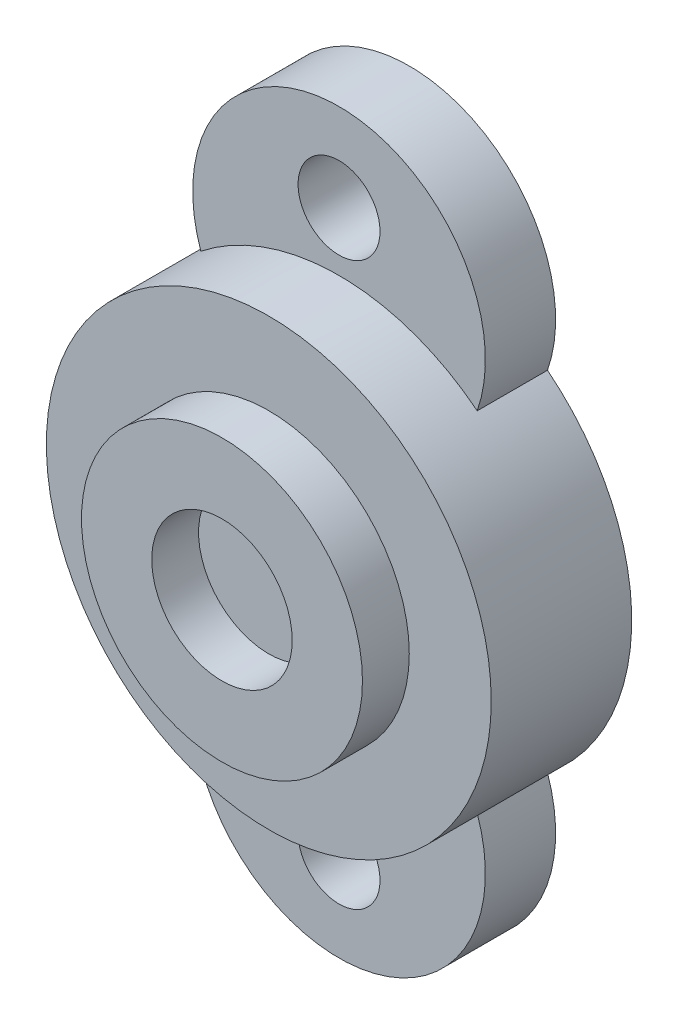
ISO-10303-21;
HEADER;
FILE_DESCRIPTION(('STEP AP214'),'2;1');
FILE_NAME('part.step','',(''),(''),'','','');
FILE_SCHEMA(('AUTOMOTIVE_DESIGN { 1 0 10303 214 1 1 1 1 }'));
ENDSEC;
DATA;
#1=APPLICATION_CONTEXT('core data for automotive mechanical design processes');
#2=APPLICATION_PROTOCOL_DEFINITION('international standard','automotive_design',2000,#1);
#3=PRODUCT_CONTEXT('',#1,'mechanical');
#4=PRODUCT('Part','Part','',(#3));
#5=PRODUCT_RELATED_PRODUCT_CATEGORY('part','',(#4));
#6=PRODUCT_DEFINITION_FORMATION('','',#4);
#7=PRODUCT_DEFINITION_CONTEXT('part definition',#1,'design');
#8=PRODUCT_DEFINITION('design','',#6,#7);
#9=PRODUCT_DEFINITION_SHAPE('','',#8);
#10=(LENGTH_UNIT() NAMED_UNIT(*) SI_UNIT(.MILLI.,.METRE.));
#11=(NAMED_UNIT(*) PLANE_ANGLE_UNIT() SI_UNIT($,.RADIAN.));
#12=(NAMED_UNIT(*) SI_UNIT($,.STERADIAN.) SOLID_ANGLE_UNIT());
#13=UNCERTAINTY_MEASURE_WITH_UNIT(LENGTH_MEASURE(1.E-05),#10,'distance_accuracy_value','');
#14=(GEOMETRIC_REPRESENTATION_CONTEXT(3) GLOBAL_UNCERTAINTY_ASSIGNED_CONTEXT((#13)) GLOBAL_UNIT_ASSIGNED_CONTEXT((#10,
#11,#12)) REPRESENTATION_CONTEXT('',''));
#15=CARTESIAN_POINT('',(0.,0.,0.));
#16=DIRECTION('',(0.,0.,1.));
#17=DIRECTION('',(1.,0.,0.));
#18=AXIS2_PLACEMENT_3D('',#15,#16,#17);
#19=CARTESIAN_POINT('',(0.,-57.3678575549034,6.));
#20=DIRECTION('',(0.,0.,1.));
#21=DIRECTION('',(1.,0.,0.));
#22=AXIS2_PLACEMENT_3D('',#19,#20,#21);
#23=PLANE('',#22);
#24=CARTESIAN_POINT('',(0.,-24.,6.));
#25=DIRECTION('',(0.,0.,1.));
#26=DIRECTION('',(1.,0.,0.));
#27=AXIS2_PLACEMENT_3D('',#24,#25,#26);
#28=CIRCLE('',#27,3.5);
#29=CARTESIAN_POINT('',(3.5,-24.,6.));
#30=VERTEX_POINT('',#29);
#31=EDGE_CURVE('E118',#30,#30,#28,.T.);
#32=ORIENTED_EDGE('',*,*,#31,.F.);
#33=EDGE_LOOP('',(#32));
#34=FACE_BOUND('',#33,.T.);
#35=CARTESIAN_POINT('',(0.,-19.,6.));
#36=DIRECTION('',(0.,0.,1.));
#37=DIRECTION('',(1.,0.,0.));
#38=AXIS2_PLACEMENT_3D('',#35,#36,#37);
#39=CIRCLE('',#38,12.5);
#40=CARTESIAN_POINT('',(-11.8043532013146,-14.8881578947368,6.));
#41=VERTEX_POINT('',#40);
#42=CARTESIAN_POINT('',(11.8043532013146,-14.8881578947368,6.));
#43=VERTEX_POINT('',#42);
#44=EDGE_CURVE('E45',#41,#43,#39,.T.);
#45=ORIENTED_EDGE('',*,*,#44,.T.);
#46=CARTESIAN_POINT('',(0.,0.,6.));
#47=DIRECTION('',(0.,0.,1.));
#48=DIRECTION('',(1.,0.,0.));
#49=AXIS2_PLACEMENT_3D('',#46,#47,#48);
#50=CIRCLE('',#49,19.);
#51=EDGE_CURVE('E49',#41,#43,#50,.T.);
#52=ORIENTED_EDGE('',*,*,#51,.F.);
#53=EDGE_LOOP('',(#45,#52));
#54=FACE_BOUND('',#53,.T.);
#55=ADVANCED_FACE('F29',(#34,#54),#23,.T.);
#56=CARTESIAN_POINT('',(0.,24.,6.));
#57=DIRECTION('',(0.,0.,1.));
#58=DIRECTION('',(1.,0.,0.));
#59=AXIS2_PLACEMENT_3D('',#56,#57,#58);
#60=CIRCLE('',#59,3.5);
#61=CARTESIAN_POINT('',(3.5,24.,6.));
#62=VERTEX_POINT('',#61);
#63=EDGE_CURVE('E121',#62,#62,#60,.T.);
#64=ORIENTED_EDGE('',*,*,#63,.F.);
#65=EDGE_LOOP('',(#64));
#66=FACE_BOUND('',#65,.T.);
#67=CARTESIAN_POINT('',(0.,19.,6.));
#68=DIRECTION('',(0.,0.,1.));
#69=DIRECTION('',(1.,0.,0.));
#70=AXIS2_PLACEMENT_3D('',#67,#68,#69);
#71=CIRCLE('',#70,12.5);
#72=CARTESIAN_POINT('',(11.8043532013146,14.8881578947368,6.));
#73=VERTEX_POINT('',#72);
#74=CARTESIAN_POINT('',(-11.8043532013146,14.8881578947368,6.));
#75=VERTEX_POINT('',#74);
#76=EDGE_CURVE('E84',#73,#75,#71,.T.);
#77=ORIENTED_EDGE('',*,*,#76,.T.);
#78=EDGE_CURVE('E77',#73,#75,#50,.T.);
#79=ORIENTED_EDGE('',*,*,#78,.F.);
#80=EDGE_LOOP('',(#77,#79));
#81=FACE_BOUND('',#80,.T.);
#82=ADVANCED_FACE('F88',(#66,#81),#23,.T.);
#83=CARTESIAN_POINT('',(0.,0.,16.));
#84=DIRECTION('',(0.,0.,-1.));
#85=DIRECTION('',(-1.,0.,0.));
#86=AXIS2_PLACEMENT_3D('',#83,#84,#85);
#87=CYLINDRICAL_SURFACE('',#86,6.);
#88=CARTESIAN_POINT('',(0.,0.,0.));
#89=DIRECTION('',(0.,0.,1.));
#90=DIRECTION('',(1.,0.,0.));
#91=AXIS2_PLACEMENT_3D('',#88,#89,#90);
#92=CIRCLE('',#91,6.);
#93=CARTESIAN_POINT('',(6.,0.,0.));
#94=VERTEX_POINT('',#93);
#95=EDGE_CURVE('E97',#94,#94,#92,.T.);
#96=ORIENTED_EDGE('',*,*,#95,.F.);
#97=EDGE_LOOP('',(#96));
#98=FACE_BOUND('',#97,.T.);
#99=CARTESIAN_POINT('',(0.,0.,6.));
#100=DIRECTION('',(0.,0.,1.));
#101=DIRECTION('',(1.,0.,0.));
#102=AXIS2_PLACEMENT_3D('',#99,#100,#101);
#103=CIRCLE('',#102,6.);
#104=CARTESIAN_POINT('',(6.,0.,6.));
#105=VERTEX_POINT('',#104);
#106=EDGE_CURVE('E92',#105,#105,#103,.T.);
#107=ORIENTED_EDGE('',*,*,#106,.T.);
#108=EDGE_LOOP('',(#107));
#109=FACE_BOUND('',#108,.T.);
#110=ADVANCED_FACE('F157',(#98,#109),#87,.F.);
#111=CARTESIAN_POINT('',(0.,19.,6.));
#112=DIRECTION('',(0.,0.,-1.));
#113=DIRECTION('',(-1.,0.,0.));
#114=AXIS2_PLACEMENT_3D('',#111,#112,#113);
#115=CYLINDRICAL_SURFACE('',#114,12.5);
#116=CARTESIAN_POINT('',(0.,19.,0.));
#117=DIRECTION('',(0.,0.,1.));
#118=DIRECTION('',(1.,0.,0.));
#119=AXIS2_PLACEMENT_3D('',#116,#117,#118);
#120=CIRCLE('',#119,12.5);
#121=CARTESIAN_POINT('',(11.8043532013146,14.8881578947368,0.));
#122=VERTEX_POINT('',#121);
#123=CARTESIAN_POINT('',(-11.8043532013146,14.8881578947368,0.));
#124=VERTEX_POINT('',#123);
#125=EDGE_CURVE('E107',#122,#124,#120,.T.);
#126=ORIENTED_EDGE('',*,*,#125,.T.);
#127=DIRECTION('',(0.,0.,-1.));
#128=VECTOR('',#127,1.);
#129=CARTESIAN_POINT('',(-11.8043532013146,14.8881578947368,6.));
#130=LINE('',#129,#128);
#131=EDGE_CURVE('E82',#75,#124,#130,.T.);
#132=ORIENTED_EDGE('',*,*,#131,.F.);
#133=ORIENTED_EDGE('',*,*,#76,.F.);
#134=DIRECTION('',(0.,0.,-1.));
#135=VECTOR('',#134,1.);
#136=CARTESIAN_POINT('',(11.8043532013146,14.8881578947368,6.));
#137=LINE('',#136,#135);
#138=EDGE_CURVE('E38',#73,#122,#137,.T.);
#139=ORIENTED_EDGE('',*,*,#138,.T.);
#140=EDGE_LOOP('',(#126,#132,#133,#139));
#141=FACE_BOUND('',#140,.T.);
#142=ADVANCED_FACE('F31',(#141),#115,.T.);
#143=CARTESIAN_POINT('',(0.,0.,6.));
#144=DIRECTION('',(0.,0.,-1.));
#145=DIRECTION('',(-1.,0.,0.));
#146=AXIS2_PLACEMENT_3D('',#143,#144,#145);
#147=CYLINDRICAL_SURFACE('',#146,19.);
#148=CARTESIAN_POINT('',(0.,0.,0.));
#149=DIRECTION('',(0.,0.,1.));
#150=DIRECTION('',(1.,0.,0.));
#151=AXIS2_PLACEMENT_3D('',#148,#149,#150);
#152=CIRCLE('',#151,19.);
#153=CARTESIAN_POINT('',(-11.8043532013146,-14.8881578947368,0.));
#154=VERTEX_POINT('',#153);
#155=EDGE_CURVE('E108',#124,#154,#152,.T.);
#156=ORIENTED_EDGE('',*,*,#155,.T.);
#157=DIRECTION('',(0.,0.,-1.));
#158=VECTOR('',#157,1.);
#159=CARTESIAN_POINT('',(-11.8043532013146,-14.8881578947368,6.));
#160=LINE('',#159,#158);
#161=EDGE_CURVE('E126',#41,#154,#160,.T.);
#162=ORIENTED_EDGE('',*,*,#161,.F.);
#163=ORIENTED_EDGE('',*,*,#51,.T.);
#164=DIRECTION('',(0.,0.,-1.));
#165=VECTOR('',#164,1.);
#166=CARTESIAN_POINT('',(11.8043532013146,-14.8881578947368,6.));
#167=LINE('',#166,#165);
#168=CARTESIAN_POINT('',(11.8043532013146,-14.8881578947368,0.));
#169=VERTEX_POINT('',#168);
#170=EDGE_CURVE('E124',#43,#169,#167,.T.);
#171=ORIENTED_EDGE('',*,*,#170,.T.);
#172=EDGE_CURVE('E80',#169,#122,#152,.T.);
#173=ORIENTED_EDGE('',*,*,#172,.T.);
#174=ORIENTED_EDGE('',*,*,#138,.F.);
#175=ORIENTED_EDGE('',*,*,#78,.T.);
#176=ORIENTED_EDGE('',*,*,#131,.T.);
#177=EDGE_LOOP('',(#156,#162,#163,#171,#173,#174,#175,#176));
#178=FACE_BOUND('',#177,.T.);
#179=CARTESIAN_POINT('',(0.,0.,12.));
#180=DIRECTION('',(0.,0.,1.));
#181=DIRECTION('',(1.,0.,0.));
#182=AXIS2_PLACEMENT_3D('',#179,#180,#181);
#183=CIRCLE('',#182,19.);
#184=CARTESIAN_POINT('',(19.,0.,12.));
#185=VERTEX_POINT('',#184);
#186=EDGE_CURVE('E89',#185,#185,#183,.T.);
#187=ORIENTED_EDGE('',*,*,#186,.F.);
#188=EDGE_LOOP('',(#187));
#189=FACE_BOUND('',#188,.T.);
#190=ADVANCED_FACE('F73',(#178,#189),#147,.T.);
#191=CARTESIAN_POINT('',(0.,-24.,6.));
#192=DIRECTION('',(0.,0.,-1.));
#193=DIRECTION('',(-1.,0.,0.));
#194=AXIS2_PLACEMENT_3D('',#191,#192,#193);
#195=CYLINDRICAL_SURFACE('',#194,3.5);
#196=ORIENTED_EDGE('',*,*,#31,.T.);
#197=EDGE_LOOP('',(#196));
#198=FACE_BOUND('',#197,.T.);
#199=CARTESIAN_POINT('',(0.,-24.,0.));
#200=DIRECTION('',(0.,0.,1.));
#201=DIRECTION('',(1.,0.,0.));
#202=AXIS2_PLACEMENT_3D('',#199,#200,#201);
#203=CIRCLE('',#202,3.5);
#204=CARTESIAN_POINT('',(3.5,-24.,0.));
#205=VERTEX_POINT('',#204);
#206=EDGE_CURVE('E112',#205,#205,#203,.T.);
#207=ORIENTED_EDGE('',*,*,#206,.F.);
#208=EDGE_LOOP('',(#207));
#209=FACE_BOUND('',#208,.T.);
#210=ADVANCED_FACE('F138',(#198,#209),#195,.F.);
#211=CARTESIAN_POINT('',(0.,-19.,6.));
#212=DIRECTION('',(0.,0.,-1.));
#213=DIRECTION('',(-1.,0.,0.));
#214=AXIS2_PLACEMENT_3D('',#211,#212,#213);
#215=CYLINDRICAL_SURFACE('',#214,12.5);
#216=CARTESIAN_POINT('',(0.,-19.,0.));
#217=DIRECTION('',(0.,0.,1.));
#218=DIRECTION('',(1.,0.,0.));
#219=AXIS2_PLACEMENT_3D('',#216,#217,#218);
#220=CIRCLE('',#219,12.5);
#221=EDGE_CURVE('E110',#154,#169,#220,.T.);
#222=ORIENTED_EDGE('',*,*,#221,.T.);
#223=ORIENTED_EDGE('',*,*,#170,.F.);
#224=ORIENTED_EDGE('',*,*,#44,.F.);
#225=ORIENTED_EDGE('',*,*,#161,.T.);
#226=EDGE_LOOP('',(#222,#223,#224,#225));
#227=FACE_BOUND('',#226,.T.);
#228=ADVANCED_FACE('F135',(#227),#215,.T.);
#229=CARTESIAN_POINT('',(0.,24.,6.));
#230=DIRECTION('',(0.,0.,-1.));
#231=DIRECTION('',(-1.,0.,0.));
#232=AXIS2_PLACEMENT_3D('',#229,#230,#231);
#233=CYLINDRICAL_SURFACE('',#232,3.5);
#234=ORIENTED_EDGE('',*,*,#63,.T.);
#235=EDGE_LOOP('',(#234));
#236=FACE_BOUND('',#235,.T.);
#237=CARTESIAN_POINT('',(0.,24.,0.));
#238=DIRECTION('',(0.,0.,1.));
#239=DIRECTION('',(1.,0.,0.));
#240=AXIS2_PLACEMENT_3D('',#237,#238,#239);
#241=CIRCLE('',#240,3.5);
#242=CARTESIAN_POINT('',(3.5,24.,0.));
#243=VERTEX_POINT('',#242);
#244=EDGE_CURVE('E86',#243,#243,#241,.T.);
#245=ORIENTED_EDGE('',*,*,#244,.F.);
#246=EDGE_LOOP('',(#245));
#247=FACE_BOUND('',#246,.T.);
#248=ADVANCED_FACE('F137',(#236,#247),#233,.F.);
#249=CARTESIAN_POINT('',(0.,-57.3678575549034,0.));
#250=DIRECTION('',(0.,0.,1.));
#251=DIRECTION('',(1.,0.,0.));
#252=AXIS2_PLACEMENT_3D('',#249,#250,#251);
#253=PLANE('',#252);
#254=ORIENTED_EDGE('',*,*,#172,.F.);
#255=ORIENTED_EDGE('',*,*,#221,.F.);
#256=ORIENTED_EDGE('',*,*,#155,.F.);
#257=ORIENTED_EDGE('',*,*,#125,.F.);
#258=EDGE_LOOP('',(#254,#255,#256,#257));
#259=FACE_BOUND('',#258,.T.);
#260=ORIENTED_EDGE('',*,*,#206,.T.);
#261=EDGE_LOOP('',(#260));
#262=FACE_BOUND('',#261,.T.);
#263=ORIENTED_EDGE('',*,*,#244,.T.);
#264=EDGE_LOOP('',(#263));
#265=FACE_BOUND('',#264,.T.);
#266=ORIENTED_EDGE('',*,*,#95,.T.);
#267=EDGE_LOOP('',(#266));
#268=FACE_BOUND('',#267,.T.);
#269=ADVANCED_FACE('F132',(#259,#262,#265,#268),#253,.F.);
#270=CARTESIAN_POINT('',(0.,0.,12.));
#271=DIRECTION('',(0.,0.,1.));
#272=DIRECTION('',(1.,0.,0.));
#273=AXIS2_PLACEMENT_3D('',#270,#271,#272);
#274=PLANE('',#273);
#275=ORIENTED_EDGE('',*,*,#186,.T.);
#276=EDGE_LOOP('',(#275));
#277=FACE_BOUND('',#276,.T.);
#278=CARTESIAN_POINT('',(0.,0.,12.));
#279=DIRECTION('',(0.,0.,1.));
#280=DIRECTION('',(1.,0.,0.));
#281=AXIS2_PLACEMENT_3D('',#278,#279,#280);
#282=CIRCLE('',#281,12.);
#283=CARTESIAN_POINT('',(12.,0.,12.));
#284=VERTEX_POINT('',#283);
#285=EDGE_CURVE('E33',#284,#284,#282,.T.);
#286=ORIENTED_EDGE('',*,*,#285,.F.);
#287=EDGE_LOOP('',(#286));
#288=FACE_BOUND('',#287,.T.);
#289=ADVANCED_FACE('F163',(#277,#288),#274,.T.);
#290=CARTESIAN_POINT('',(0.,0.,6.));
#291=DIRECTION('',(0.,0.,1.));
#292=DIRECTION('',(1.,0.,0.));
#293=AXIS2_PLACEMENT_3D('',#290,#291,#292);
#294=PLANE('',#293);
#295=ORIENTED_EDGE('',*,*,#106,.F.);
#296=EDGE_LOOP('',(#295));
#297=FACE_BOUND('',#296,.T.);
#298=ADVANCED_FACE('F168',(#297),#294,.F.);
#299=CARTESIAN_POINT('',(0.,0.,12.));
#300=DIRECTION('',(0.,0.,1.));
#301=DIRECTION('',(1.,0.,0.));
#302=AXIS2_PLACEMENT_3D('',#299,#300,#301);
#303=CIRCLE('',#302,6.);
#304=CARTESIAN_POINT('',(6.,0.,12.));
#305=VERTEX_POINT('',#304);
#306=EDGE_CURVE('E11',#305,#305,#303,.T.);
#307=ORIENTED_EDGE('',*,*,#306,.F.);
#308=EDGE_LOOP('',(#307));
#309=FACE_BOUND('',#308,.T.);
#310=CARTESIAN_POINT('',(0.,0.,16.));
#311=DIRECTION('',(0.,0.,1.));
#312=DIRECTION('',(1.,0.,0.));
#313=AXIS2_PLACEMENT_3D('',#310,#311,#312);
#314=CIRCLE('',#313,6.);
#315=CARTESIAN_POINT('',(6.,0.,16.));
#316=VERTEX_POINT('',#315);
#317=EDGE_CURVE('E100',#316,#316,#314,.T.);
#318=ORIENTED_EDGE('',*,*,#317,.T.);
#319=EDGE_LOOP('',(#318));
#320=FACE_BOUND('',#319,.T.);
#321=ADVANCED_FACE('F164',(#309,#320),#87,.F.);
#322=CARTESIAN_POINT('',(0.,-57.3678575549034,16.));
#323=DIRECTION('',(0.,0.,1.));
#324=DIRECTION('',(1.,0.,0.));
#325=AXIS2_PLACEMENT_3D('',#322,#323,#324);
#326=PLANE('',#325);
#327=ORIENTED_EDGE('',*,*,#317,.F.);
#328=EDGE_LOOP('',(#327));
#329=FACE_BOUND('',#328,.T.);
#330=CARTESIAN_POINT('',(0.,0.,16.));
#331=DIRECTION('',(0.,0.,1.));
#332=DIRECTION('',(1.,0.,0.));
#333=AXIS2_PLACEMENT_3D('',#330,#331,#332);
#334=CIRCLE('',#333,12.);
#335=CARTESIAN_POINT('',(12.,0.,16.));
#336=VERTEX_POINT('',#335);
#337=EDGE_CURVE('E103',#336,#336,#334,.T.);
#338=ORIENTED_EDGE('',*,*,#337,.T.);
#339=EDGE_LOOP('',(#338));
#340=FACE_BOUND('',#339,.T.);
#341=ADVANCED_FACE('F167',(#329,#340),#326,.T.);
#342=CARTESIAN_POINT('',(0.,0.,16.));
#343=DIRECTION('',(0.,0.,-1.));
#344=DIRECTION('',(-1.,0.,0.));
#345=AXIS2_PLACEMENT_3D('',#342,#343,#344);
#346=CYLINDRICAL_SURFACE('',#345,12.);
#347=ORIENTED_EDGE('',*,*,#285,.T.);
#348=EDGE_LOOP('',(#347));
#349=FACE_BOUND('',#348,.T.);
#350=ORIENTED_EDGE('',*,*,#337,.F.);
#351=EDGE_LOOP('',(#350));
#352=FACE_BOUND('',#351,.T.);
#353=ADVANCED_FACE('F170',(#349,#352),#346,.T.);
#354=ORIENTED_EDGE('',*,*,#306,.T.);
#355=EDGE_LOOP('',(#354));
#356=FACE_BOUND('',#355,.T.);
#357=ADVANCED_FACE('F173',(#356),#274,.T.);
#358=CLOSED_SHELL('',(#55,#82,#110,#142,#190,#210,#228,#248,#269,#289,#298,#321,#341,#353,#357));
#359=MANIFOLD_SOLID_BREP('B2',#358);
#360=ADVANCED_BREP_SHAPE_REPRESENTATION('',(#18,#359),#14);
#361=SHAPE_DEFINITION_REPRESENTATION(#9,#360);
ENDSEC;
END-ISO-10303-21;
